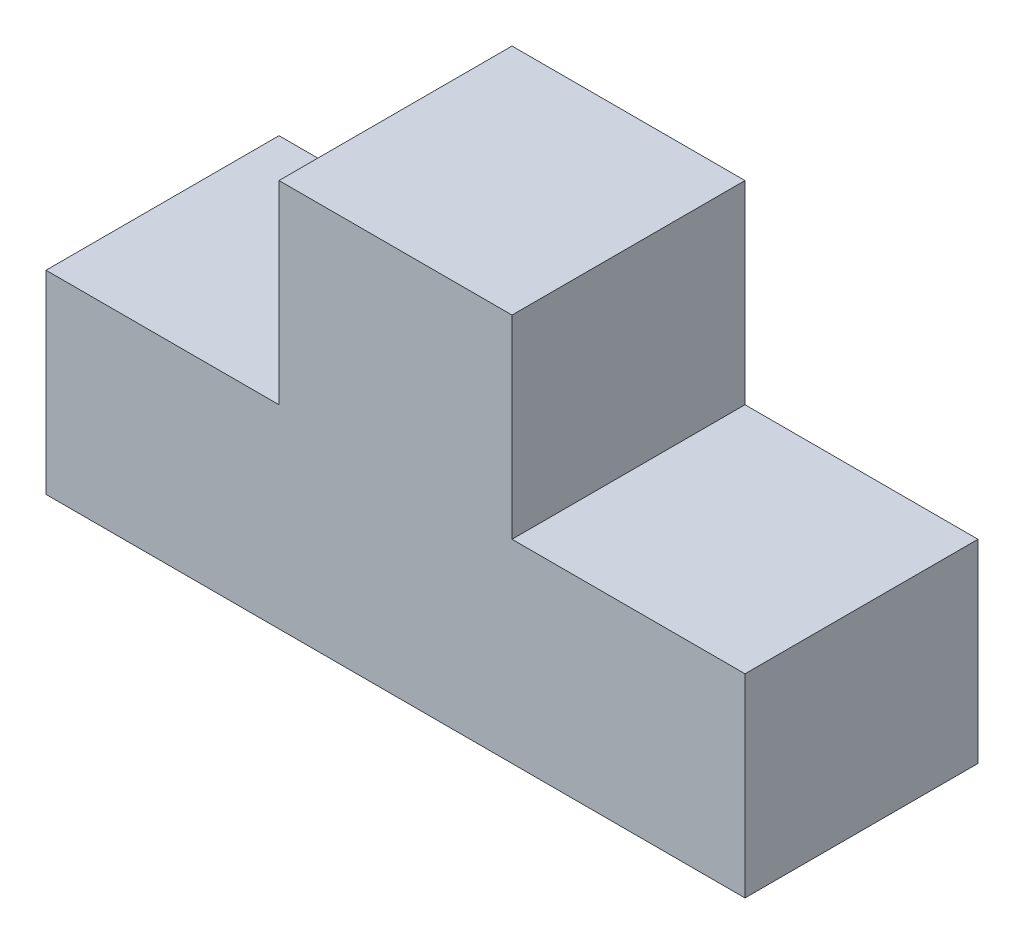
ISO-10303-21;
HEADER;
FILE_DESCRIPTION(('STEP AP214'),'2;1');
FILE_NAME('part.step','',(''),(''),'','','');
FILE_SCHEMA(('AUTOMOTIVE_DESIGN { 1 0 10303 214 1 1 1 1 }'));
ENDSEC;
DATA;
#1=APPLICATION_CONTEXT('core data for automotive mechanical design processes');
#2=APPLICATION_PROTOCOL_DEFINITION('international standard','automotive_design',2000,#1);
#3=PRODUCT_CONTEXT('',#1,'mechanical');
#4=PRODUCT('Part','Part','',(#3));
#5=PRODUCT_RELATED_PRODUCT_CATEGORY('part','',(#4));
#6=PRODUCT_DEFINITION_FORMATION('','',#4);
#7=PRODUCT_DEFINITION_CONTEXT('part definition',#1,'design');
#8=PRODUCT_DEFINITION('design','',#6,#7);
#9=PRODUCT_DEFINITION_SHAPE('','',#8);
#10=(LENGTH_UNIT() NAMED_UNIT(*) SI_UNIT(.MILLI.,.METRE.));
#11=(NAMED_UNIT(*) PLANE_ANGLE_UNIT() SI_UNIT($,.RADIAN.));
#12=(NAMED_UNIT(*) SI_UNIT($,.STERADIAN.) SOLID_ANGLE_UNIT());
#13=UNCERTAINTY_MEASURE_WITH_UNIT(LENGTH_MEASURE(1.E-05),#10,'distance_accuracy_value','');
#14=(GEOMETRIC_REPRESENTATION_CONTEXT(3) GLOBAL_UNCERTAINTY_ASSIGNED_CONTEXT((#13)) GLOBAL_UNIT_ASSIGNED_CONTEXT((#10,
#11,#12)) REPRESENTATION_CONTEXT('',''));
#15=CARTESIAN_POINT('',(0.,0.,0.));
#16=DIRECTION('',(0.,0.,1.));
#17=DIRECTION('',(1.,0.,0.));
#18=AXIS2_PLACEMENT_3D('',#15,#16,#17);
#19=CARTESIAN_POINT('',(45.,0.,30.));
#20=DIRECTION('',(-1.,0.,0.));
#21=DIRECTION('',(0.,-1.,0.));
#22=AXIS2_PLACEMENT_3D('',#19,#20,#21);
#23=PLANE('',#22);
#24=DIRECTION('',(0.,1.,0.));
#25=VECTOR('',#24,1.);
#26=CARTESIAN_POINT('',(45.,0.,0.));
#27=LINE('',#26,#25);
#28=CARTESIAN_POINT('',(45.,0.,0.));
#29=VERTEX_POINT('',#28);
#30=CARTESIAN_POINT('',(45.,25.,0.));
#31=VERTEX_POINT('',#30);
#32=EDGE_CURVE('E129',#29,#31,#27,.T.);
#33=ORIENTED_EDGE('',*,*,#32,.T.);
#34=DIRECTION('',(0.,0.,-1.));
#35=VECTOR('',#34,1.);
#36=CARTESIAN_POINT('',(45.,25.,30.));
#37=LINE('',#36,#35);
#38=CARTESIAN_POINT('',(45.,25.,30.));
#39=VERTEX_POINT('',#38);
#40=EDGE_CURVE('E11',#39,#31,#37,.T.);
#41=ORIENTED_EDGE('',*,*,#40,.F.);
#42=DIRECTION('',(0.,1.,0.));
#43=VECTOR('',#42,1.);
#44=CARTESIAN_POINT('',(45.,0.,30.));
#45=LINE('',#44,#43);
#46=CARTESIAN_POINT('',(45.,0.,30.));
#47=VERTEX_POINT('',#46);
#48=EDGE_CURVE('E143',#47,#39,#45,.T.);
#49=ORIENTED_EDGE('',*,*,#48,.F.);
#50=DIRECTION('',(0.,0.,-1.));
#51=VECTOR('',#50,1.);
#52=CARTESIAN_POINT('',(45.,0.,30.));
#53=LINE('',#52,#51);
#54=EDGE_CURVE('E125',#47,#29,#53,.T.);
#55=ORIENTED_EDGE('',*,*,#54,.T.);
#56=EDGE_LOOP('',(#33,#41,#49,#55));
#57=FACE_BOUND('',#56,.T.);
#58=ADVANCED_FACE('F33',(#57),#23,.F.);
#59=CARTESIAN_POINT('',(45.,25.,30.));
#60=DIRECTION('',(0.,-1.,0.));
#61=DIRECTION('',(0.,0.,-1.));
#62=AXIS2_PLACEMENT_3D('',#59,#60,#61);
#63=PLANE('',#62);
#64=DIRECTION('',(-1.,0.,0.));
#65=VECTOR('',#64,1.);
#66=CARTESIAN_POINT('',(45.,25.,0.));
#67=LINE('',#66,#65);
#68=CARTESIAN_POINT('',(15.,25.,0.));
#69=VERTEX_POINT('',#68);
#70=EDGE_CURVE('E132',#31,#69,#67,.T.);
#71=ORIENTED_EDGE('',*,*,#70,.T.);
#72=DIRECTION('',(0.,0.,-1.));
#73=VECTOR('',#72,1.);
#74=CARTESIAN_POINT('',(15.,25.,30.));
#75=LINE('',#74,#73);
#76=CARTESIAN_POINT('',(15.,25.,30.));
#77=VERTEX_POINT('',#76);
#78=EDGE_CURVE('E41',#77,#69,#75,.T.);
#79=ORIENTED_EDGE('',*,*,#78,.F.);
#80=DIRECTION('',(-1.,0.,0.));
#81=VECTOR('',#80,1.);
#82=CARTESIAN_POINT('',(45.,25.,30.));
#83=LINE('',#82,#81);
#84=EDGE_CURVE('E92',#39,#77,#83,.T.);
#85=ORIENTED_EDGE('',*,*,#84,.F.);
#86=ORIENTED_EDGE('',*,*,#40,.T.);
#87=EDGE_LOOP('',(#71,#79,#85,#86));
#88=FACE_BOUND('',#87,.T.);
#89=ADVANCED_FACE('F178',(#88),#63,.F.);
#90=CARTESIAN_POINT('',(15.,25.,30.));
#91=DIRECTION('',(-1.,0.,0.));
#92=DIRECTION('',(0.,0.,1.));
#93=AXIS2_PLACEMENT_3D('',#90,#91,#92);
#94=PLANE('',#93);
#95=DIRECTION('',(0.,1.,0.));
#96=VECTOR('',#95,1.);
#97=CARTESIAN_POINT('',(15.,25.,0.));
#98=LINE('',#97,#96);
#99=CARTESIAN_POINT('',(15.,50.,0.));
#100=VERTEX_POINT('',#99);
#101=EDGE_CURVE('E134',#69,#100,#98,.T.);
#102=ORIENTED_EDGE('',*,*,#101,.T.);
#103=DIRECTION('',(0.,0.,-1.));
#104=VECTOR('',#103,1.);
#105=CARTESIAN_POINT('',(15.,50.,30.));
#106=LINE('',#105,#104);
#107=CARTESIAN_POINT('',(15.,50.,30.));
#108=VERTEX_POINT('',#107);
#109=EDGE_CURVE('E150',#108,#100,#106,.T.);
#110=ORIENTED_EDGE('',*,*,#109,.F.);
#111=DIRECTION('',(0.,1.,0.));
#112=VECTOR('',#111,1.);
#113=CARTESIAN_POINT('',(15.,25.,30.));
#114=LINE('',#113,#112);
#115=EDGE_CURVE('E158',#77,#108,#114,.T.);
#116=ORIENTED_EDGE('',*,*,#115,.F.);
#117=ORIENTED_EDGE('',*,*,#78,.T.);
#118=EDGE_LOOP('',(#102,#110,#116,#117));
#119=FACE_BOUND('',#118,.T.);
#120=ADVANCED_FACE('F156',(#119),#94,.F.);
#121=CARTESIAN_POINT('',(15.,50.,30.));
#122=DIRECTION('',(0.,-1.,0.));
#123=DIRECTION('',(0.,0.,-1.));
#124=AXIS2_PLACEMENT_3D('',#121,#122,#123);
#125=PLANE('',#124);
#126=DIRECTION('',(-1.,0.,0.));
#127=VECTOR('',#126,1.);
#128=CARTESIAN_POINT('',(15.,50.,0.));
#129=LINE('',#128,#127);
#130=CARTESIAN_POINT('',(-15.,50.,0.));
#131=VERTEX_POINT('',#130);
#132=EDGE_CURVE('E136',#100,#131,#129,.T.);
#133=ORIENTED_EDGE('',*,*,#132,.T.);
#134=DIRECTION('',(0.,0.,-1.));
#135=VECTOR('',#134,1.);
#136=CARTESIAN_POINT('',(-15.,50.,30.));
#137=LINE('',#136,#135);
#138=CARTESIAN_POINT('',(-15.,50.,30.));
#139=VERTEX_POINT('',#138);
#140=EDGE_CURVE('E147',#139,#131,#137,.T.);
#141=ORIENTED_EDGE('',*,*,#140,.F.);
#142=DIRECTION('',(-1.,0.,0.));
#143=VECTOR('',#142,1.);
#144=CARTESIAN_POINT('',(15.,50.,30.));
#145=LINE('',#144,#143);
#146=EDGE_CURVE('E170',#108,#139,#145,.T.);
#147=ORIENTED_EDGE('',*,*,#146,.F.);
#148=ORIENTED_EDGE('',*,*,#109,.T.);
#149=EDGE_LOOP('',(#133,#141,#147,#148));
#150=FACE_BOUND('',#149,.T.);
#151=ADVANCED_FACE('F166',(#150),#125,.F.);
#152=CARTESIAN_POINT('',(-15.,25.,30.));
#153=DIRECTION('',(1.,0.,0.));
#154=DIRECTION('',(0.,0.,-1.));
#155=AXIS2_PLACEMENT_3D('',#152,#153,#154);
#156=PLANE('',#155);
#157=DIRECTION('',(0.,-1.,0.));
#158=VECTOR('',#157,1.);
#159=CARTESIAN_POINT('',(-15.,25.,0.));
#160=LINE('',#159,#158);
#161=CARTESIAN_POINT('',(-15.,25.,0.));
#162=VERTEX_POINT('',#161);
#163=EDGE_CURVE('E138',#131,#162,#160,.T.);
#164=ORIENTED_EDGE('',*,*,#163,.T.);
#165=DIRECTION('',(0.,0.,-1.));
#166=VECTOR('',#165,1.);
#167=CARTESIAN_POINT('',(-15.,25.,30.));
#168=LINE('',#167,#166);
#169=CARTESIAN_POINT('',(-15.,25.,30.));
#170=VERTEX_POINT('',#169);
#171=EDGE_CURVE('E120',#170,#162,#168,.T.);
#172=ORIENTED_EDGE('',*,*,#171,.F.);
#173=DIRECTION('',(0.,-1.,0.));
#174=VECTOR('',#173,1.);
#175=CARTESIAN_POINT('',(-15.,25.,30.));
#176=LINE('',#175,#174);
#177=EDGE_CURVE('E111',#139,#170,#176,.T.);
#178=ORIENTED_EDGE('',*,*,#177,.F.);
#179=ORIENTED_EDGE('',*,*,#140,.T.);
#180=EDGE_LOOP('',(#164,#172,#178,#179));
#181=FACE_BOUND('',#180,.T.);
#182=ADVANCED_FACE('F169',(#181),#156,.F.);
#183=CARTESIAN_POINT('',(-45.,25.,30.));
#184=DIRECTION('',(0.,-1.,0.));
#185=DIRECTION('',(0.,0.,-1.));
#186=AXIS2_PLACEMENT_3D('',#183,#184,#185);
#187=PLANE('',#186);
#188=DIRECTION('',(-1.,0.,0.));
#189=VECTOR('',#188,1.);
#190=CARTESIAN_POINT('',(-45.,25.,0.));
#191=LINE('',#190,#189);
#192=CARTESIAN_POINT('',(-45.,25.,0.));
#193=VERTEX_POINT('',#192);
#194=EDGE_CURVE('E119',#162,#193,#191,.T.);
#195=ORIENTED_EDGE('',*,*,#194,.T.);
#196=DIRECTION('',(0.,0.,-1.));
#197=VECTOR('',#196,1.);
#198=CARTESIAN_POINT('',(-45.,25.,30.));
#199=LINE('',#198,#197);
#200=CARTESIAN_POINT('',(-45.,25.,30.));
#201=VERTEX_POINT('',#200);
#202=EDGE_CURVE('E116',#201,#193,#199,.T.);
#203=ORIENTED_EDGE('',*,*,#202,.F.);
#204=DIRECTION('',(-1.,0.,0.));
#205=VECTOR('',#204,1.);
#206=CARTESIAN_POINT('',(-45.,25.,30.));
#207=LINE('',#206,#205);
#208=EDGE_CURVE('E105',#170,#201,#207,.T.);
#209=ORIENTED_EDGE('',*,*,#208,.F.);
#210=ORIENTED_EDGE('',*,*,#171,.T.);
#211=EDGE_LOOP('',(#195,#203,#209,#210));
#212=FACE_BOUND('',#211,.T.);
#213=ADVANCED_FACE('F117',(#212),#187,.F.);
#214=CARTESIAN_POINT('',(-45.,0.,30.));
#215=DIRECTION('',(1.,0.,0.));
#216=DIRECTION('',(0.,1.,0.));
#217=AXIS2_PLACEMENT_3D('',#214,#215,#216);
#218=PLANE('',#217);
#219=DIRECTION('',(0.,-1.,0.));
#220=VECTOR('',#219,1.);
#221=CARTESIAN_POINT('',(-45.,0.,0.));
#222=LINE('',#221,#220);
#223=CARTESIAN_POINT('',(-45.,0.,0.));
#224=VERTEX_POINT('',#223);
#225=EDGE_CURVE('E78',#193,#224,#222,.T.);
#226=ORIENTED_EDGE('',*,*,#225,.T.);
#227=DIRECTION('',(0.,0.,-1.));
#228=VECTOR('',#227,1.);
#229=CARTESIAN_POINT('',(-45.,0.,30.));
#230=LINE('',#229,#228);
#231=CARTESIAN_POINT('',(-45.,0.,30.));
#232=VERTEX_POINT('',#231);
#233=EDGE_CURVE('E121',#232,#224,#230,.T.);
#234=ORIENTED_EDGE('',*,*,#233,.F.);
#235=DIRECTION('',(0.,-1.,0.));
#236=VECTOR('',#235,1.);
#237=CARTESIAN_POINT('',(-45.,0.,30.));
#238=LINE('',#237,#236);
#239=EDGE_CURVE('E109',#201,#232,#238,.T.);
#240=ORIENTED_EDGE('',*,*,#239,.F.);
#241=ORIENTED_EDGE('',*,*,#202,.T.);
#242=EDGE_LOOP('',(#226,#234,#240,#241));
#243=FACE_BOUND('',#242,.T.);
#244=ADVANCED_FACE('F123',(#243),#218,.F.);
#245=CARTESIAN_POINT('',(-45.,0.,30.));
#246=DIRECTION('',(0.,1.,0.));
#247=DIRECTION('',(-1.,0.,0.));
#248=AXIS2_PLACEMENT_3D('',#245,#246,#247);
#249=PLANE('',#248);
#250=DIRECTION('',(1.,0.,0.));
#251=VECTOR('',#250,1.);
#252=CARTESIAN_POINT('',(-45.,0.,0.));
#253=LINE('',#252,#251);
#254=EDGE_CURVE('E84',#224,#29,#253,.T.);
#255=ORIENTED_EDGE('',*,*,#254,.T.);
#256=ORIENTED_EDGE('',*,*,#54,.F.);
#257=DIRECTION('',(1.,0.,0.));
#258=VECTOR('',#257,1.);
#259=CARTESIAN_POINT('',(-45.,0.,30.));
#260=LINE('',#259,#258);
#261=EDGE_CURVE('E49',#232,#47,#260,.T.);
#262=ORIENTED_EDGE('',*,*,#261,.F.);
#263=ORIENTED_EDGE('',*,*,#233,.T.);
#264=EDGE_LOOP('',(#255,#256,#262,#263));
#265=FACE_BOUND('',#264,.T.);
#266=ADVANCED_FACE('F194',(#265),#249,.F.);
#267=CARTESIAN_POINT('',(0.,0.,30.));
#268=DIRECTION('',(0.,0.,1.));
#269=DIRECTION('',(1.,0.,0.));
#270=AXIS2_PLACEMENT_3D('',#267,#268,#269);
#271=PLANE('',#270);
#272=ORIENTED_EDGE('',*,*,#48,.T.);
#273=ORIENTED_EDGE('',*,*,#84,.T.);
#274=ORIENTED_EDGE('',*,*,#115,.T.);
#275=ORIENTED_EDGE('',*,*,#146,.T.);
#276=ORIENTED_EDGE('',*,*,#177,.T.);
#277=ORIENTED_EDGE('',*,*,#208,.T.);
#278=ORIENTED_EDGE('',*,*,#239,.T.);
#279=ORIENTED_EDGE('',*,*,#261,.T.);
#280=EDGE_LOOP('',(#272,#273,#274,#275,#276,#277,#278,#279));
#281=FACE_BOUND('',#280,.T.);
#282=ADVANCED_FACE('F107',(#281),#271,.T.);
#283=CARTESIAN_POINT('',(0.,0.,0.));
#284=DIRECTION('',(0.,0.,1.));
#285=DIRECTION('',(1.,0.,0.));
#286=AXIS2_PLACEMENT_3D('',#283,#284,#285);
#287=PLANE('',#286);
#288=ORIENTED_EDGE('',*,*,#32,.F.);
#289=ORIENTED_EDGE('',*,*,#254,.F.);
#290=ORIENTED_EDGE('',*,*,#225,.F.);
#291=ORIENTED_EDGE('',*,*,#194,.F.);
#292=ORIENTED_EDGE('',*,*,#163,.F.);
#293=ORIENTED_EDGE('',*,*,#132,.F.);
#294=ORIENTED_EDGE('',*,*,#101,.F.);
#295=ORIENTED_EDGE('',*,*,#70,.F.);
#296=EDGE_LOOP('',(#288,#289,#290,#291,#292,#293,#294,#295));
#297=FACE_BOUND('',#296,.T.);
#298=ADVANCED_FACE('F162',(#297),#287,.F.);
#299=CLOSED_SHELL('',(#58,#89,#120,#151,#182,#213,#244,#266,#282,#298));
#300=MANIFOLD_SOLID_BREP('B2',#299);
#301=ADVANCED_BREP_SHAPE_REPRESENTATION('',(#18,#300),#14);
#302=SHAPE_DEFINITION_REPRESENTATION(#9,#301);
ENDSEC;
END-ISO-10303-21;
